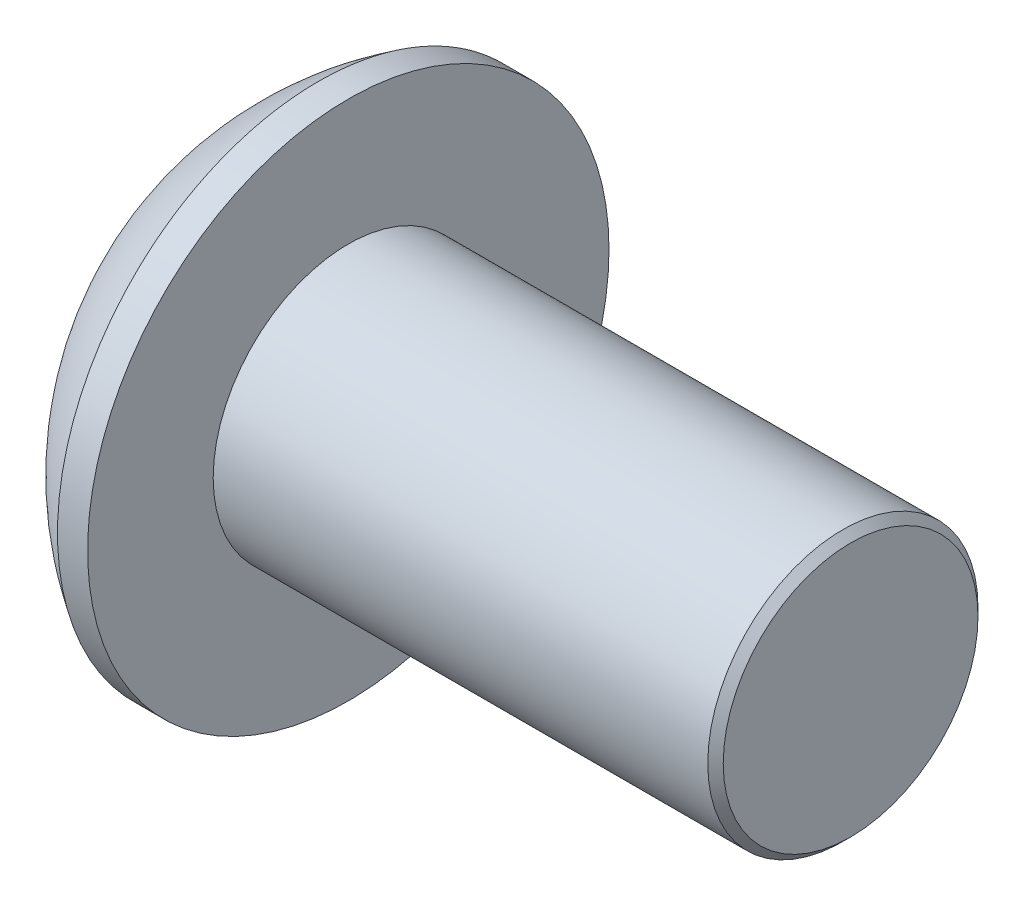
ISO-10303-21;
HEADER;
FILE_DESCRIPTION(('STEP AP214'),'2;1');
FILE_NAME('part.step','',(''),(''),'','','');
FILE_SCHEMA(('AUTOMOTIVE_DESIGN { 1 0 10303 214 1 1 1 1 }'));
ENDSEC;
DATA;
#1=APPLICATION_CONTEXT('core data for automotive mechanical design processes');
#2=APPLICATION_PROTOCOL_DEFINITION('international standard','automotive_design',2000,#1);
#3=PRODUCT_CONTEXT('',#1,'mechanical');
#4=PRODUCT('Part','Part','',(#3));
#5=PRODUCT_RELATED_PRODUCT_CATEGORY('part','',(#4));
#6=PRODUCT_DEFINITION_FORMATION('','',#4);
#7=PRODUCT_DEFINITION_CONTEXT('part definition',#1,'design');
#8=PRODUCT_DEFINITION('design','',#6,#7);
#9=PRODUCT_DEFINITION_SHAPE('','',#8);
#10=(LENGTH_UNIT() NAMED_UNIT(*) SI_UNIT(.MILLI.,.METRE.));
#11=(NAMED_UNIT(*) PLANE_ANGLE_UNIT() SI_UNIT($,.RADIAN.));
#12=(NAMED_UNIT(*) SI_UNIT($,.STERADIAN.) SOLID_ANGLE_UNIT());
#13=UNCERTAINTY_MEASURE_WITH_UNIT(LENGTH_MEASURE(1.E-05),#10,'distance_accuracy_value','');
#14=(GEOMETRIC_REPRESENTATION_CONTEXT(3) GLOBAL_UNCERTAINTY_ASSIGNED_CONTEXT((#13)) GLOBAL_UNIT_ASSIGNED_CONTEXT((#10,
#11,#12)) REPRESENTATION_CONTEXT('',''));
#15=CARTESIAN_POINT('',(0.,0.,0.));
#16=DIRECTION('',(0.,0.,1.));
#17=DIRECTION('',(1.,0.,0.));
#18=AXIS2_PLACEMENT_3D('',#15,#16,#17);
#19=CARTESIAN_POINT('',(1.32080000000034,0.,0.));
#20=DIRECTION('',(-1.,0.,0.));
#21=DIRECTION('',(0.,0.,-1.));
#22=AXIS2_PLACEMENT_3D('',#19,#20,#21);
#23=CONICAL_SURFACE('',#22,1.1937999999998,1.04719755119608);
#24=CARTESIAN_POINT('',(2.01004075135902,0.,-4.44089209850063E-13));
#25=VERTEX_POINT('',#24);
#26=VERTEX_LOOP('',#25);
#27=FACE_BOUND('',#26,.T.);
#28=CARTESIAN_POINT('',(1.32080000000009,0.,0.));
#29=DIRECTION('',(1.,0.,0.));
#30=DIRECTION('',(0.,0.,-1.));
#31=AXIS2_PLACEMENT_3D('',#28,#29,#30);
#32=CIRCLE('',#31,1.19380000000024);
#33=CARTESIAN_POINT('',(1.32080000000004,-1.03386112703797,-0.59690000000006));
#34=VERTEX_POINT('',#33);
#35=CARTESIAN_POINT('',(1.32080000000004,0.,-1.19380000000012));
#36=VERTEX_POINT('',#35);
#37=EDGE_CURVE('E37',#34,#36,#32,.T.);
#38=ORIENTED_EDGE('',*,*,#37,.F.);
#39=CARTESIAN_POINT('',(1.32080000000009,0.,0.));
#40=DIRECTION('',(1.,0.,0.));
#41=DIRECTION('',(0.,0.,-1.));
#42=AXIS2_PLACEMENT_3D('',#39,#40,#41);
#43=CIRCLE('',#42,1.19380000000024);
#44=CARTESIAN_POINT('',(1.32080000000004,-1.03386112703797,0.59690000000006));
#45=VERTEX_POINT('',#44);
#46=EDGE_CURVE('E127',#45,#34,#43,.T.);
#47=ORIENTED_EDGE('',*,*,#46,.F.);
#48=CARTESIAN_POINT('',(1.32080000000009,0.,0.));
#49=DIRECTION('',(1.,0.,0.));
#50=DIRECTION('',(0.,0.,-1.));
#51=AXIS2_PLACEMENT_3D('',#48,#49,#50);
#52=CIRCLE('',#51,1.19380000000024);
#53=CARTESIAN_POINT('',(1.32080000000004,1.49457637585666E-12,1.19380000000012));
#54=VERTEX_POINT('',#53);
#55=EDGE_CURVE('E133',#54,#45,#52,.T.);
#56=ORIENTED_EDGE('',*,*,#55,.F.);
#57=CARTESIAN_POINT('',(1.32080000000009,0.,0.));
#58=DIRECTION('',(1.,0.,0.));
#59=DIRECTION('',(0.,0.,-1.));
#60=AXIS2_PLACEMENT_3D('',#57,#58,#59);
#61=CIRCLE('',#60,1.19380000000024);
#62=CARTESIAN_POINT('',(1.32080000000004,1.03386112703797,0.596900000000061));
#63=VERTEX_POINT('',#62);
#64=EDGE_CURVE('E147',#63,#54,#61,.T.);
#65=ORIENTED_EDGE('',*,*,#64,.F.);
#66=CARTESIAN_POINT('',(1.32080000000009,0.,0.));
#67=DIRECTION('',(1.,0.,0.));
#68=DIRECTION('',(0.,0.,-1.));
#69=AXIS2_PLACEMENT_3D('',#66,#67,#68);
#70=CIRCLE('',#69,1.19380000000024);
#71=CARTESIAN_POINT('',(1.32080000000004,1.03386112703797,-0.596900000000061));
#72=VERTEX_POINT('',#71);
#73=EDGE_CURVE('E140',#72,#63,#70,.T.);
#74=ORIENTED_EDGE('',*,*,#73,.F.);
#75=CARTESIAN_POINT('',(1.32080000000009,0.,0.));
#76=DIRECTION('',(1.,0.,0.));
#77=DIRECTION('',(0.,0.,-1.));
#78=AXIS2_PLACEMENT_3D('',#75,#76,#77);
#79=CIRCLE('',#78,1.19380000000024);
#80=EDGE_CURVE('E137',#36,#72,#79,.T.);
#81=ORIENTED_EDGE('',*,*,#80,.F.);
#82=EDGE_LOOP('',(#38,#47,#56,#65,#74,#81));
#83=FACE_BOUND('',#82,.T.);
#84=ADVANCED_FACE('F34',(#27,#83),#23,.F.);
#85=CARTESIAN_POINT('',(1.3208,-2.06772225407572,1.1938));
#86=DIRECTION('',(1.,0.,0.));
#87=DIRECTION('',(0.,0.,1.));
#88=AXIS2_PLACEMENT_3D('',#85,#86,#87);
#89=PLANE('',#88);
#90=DIRECTION('',(0.,0.5,-0.866025403784439));
#91=VECTOR('',#90,1.);
#92=CARTESIAN_POINT('',(1.3208,-1.37848150271715,0.));
#93=LINE('',#92,#91);
#94=CARTESIAN_POINT('',(1.3208,-0.689240751358574,-1.1938));
#95=VERTEX_POINT('',#94);
#96=EDGE_CURVE('E109',#95,#34,#93,.F.);
#97=ORIENTED_EDGE('',*,*,#96,.T.);
#98=ORIENTED_EDGE('',*,*,#37,.T.);
#99=DIRECTION('',(0.,1.,0.));
#100=VECTOR('',#99,1.);
#101=CARTESIAN_POINT('',(1.3208,-0.689240751358574,-1.1938));
#102=LINE('',#101,#100);
#103=EDGE_CURVE('E124',#36,#95,#102,.F.);
#104=ORIENTED_EDGE('',*,*,#103,.T.);
#105=EDGE_LOOP('',(#97,#98,#104));
#106=FACE_BOUND('',#105,.T.);
#107=ADVANCED_FACE('F121',(#106),#89,.F.);
#108=CARTESIAN_POINT('',(1.3208,-2.06772225407572,1.1938));
#109=DIRECTION('',(1.,0.,0.));
#110=DIRECTION('',(0.,0.,1.));
#111=AXIS2_PLACEMENT_3D('',#108,#109,#110);
#112=PLANE('',#111);
#113=DIRECTION('',(0.,-0.5,-0.866025403784439));
#114=VECTOR('',#113,1.);
#115=CARTESIAN_POINT('',(1.3208,-0.689240751358574,1.1938));
#116=LINE('',#115,#114);
#117=CARTESIAN_POINT('',(1.3208,-1.37848150271715,0.));
#118=VERTEX_POINT('',#117);
#119=EDGE_CURVE('E129',#118,#45,#116,.F.);
#120=ORIENTED_EDGE('',*,*,#119,.T.);
#121=ORIENTED_EDGE('',*,*,#46,.T.);
#122=DIRECTION('',(0.,0.5,-0.866025403784439));
#123=VECTOR('',#122,1.);
#124=CARTESIAN_POINT('',(1.3208,-1.37848150271715,0.));
#125=LINE('',#124,#123);
#126=EDGE_CURVE('E104',#34,#118,#125,.F.);
#127=ORIENTED_EDGE('',*,*,#126,.T.);
#128=EDGE_LOOP('',(#120,#121,#127));
#129=FACE_BOUND('',#128,.T.);
#130=ADVANCED_FACE('F128',(#129),#112,.F.);
#131=CARTESIAN_POINT('',(1.3208,-2.06772225407572,1.1938));
#132=DIRECTION('',(1.,0.,0.));
#133=DIRECTION('',(0.,0.,1.));
#134=AXIS2_PLACEMENT_3D('',#131,#132,#133);
#135=PLANE('',#134);
#136=DIRECTION('',(0.,1.,0.));
#137=VECTOR('',#136,1.);
#138=CARTESIAN_POINT('',(1.3208,0.689240751358577,1.1938));
#139=LINE('',#138,#137);
#140=CARTESIAN_POINT('',(1.3208,-0.689240751358574,1.1938));
#141=VERTEX_POINT('',#140);
#142=EDGE_CURVE('E166',#141,#54,#139,.T.);
#143=ORIENTED_EDGE('',*,*,#142,.T.);
#144=ORIENTED_EDGE('',*,*,#55,.T.);
#145=DIRECTION('',(0.,-0.5,-0.866025403784439));
#146=VECTOR('',#145,1.);
#147=CARTESIAN_POINT('',(1.3208,-0.689240751358574,1.1938));
#148=LINE('',#147,#146);
#149=EDGE_CURVE('E164',#45,#141,#148,.F.);
#150=ORIENTED_EDGE('',*,*,#149,.T.);
#151=EDGE_LOOP('',(#143,#144,#150));
#152=FACE_BOUND('',#151,.T.);
#153=ADVANCED_FACE('F163',(#152),#135,.F.);
#154=CARTESIAN_POINT('',(1.3208,-2.06772225407572,1.1938));
#155=DIRECTION('',(1.,0.,0.));
#156=DIRECTION('',(0.,0.,1.));
#157=AXIS2_PLACEMENT_3D('',#154,#155,#156);
#158=PLANE('',#157);
#159=DIRECTION('',(0.,-0.5,0.866025403784439));
#160=VECTOR('',#159,1.);
#161=CARTESIAN_POINT('',(1.3208,1.37848150271715,0.));
#162=LINE('',#161,#160);
#163=CARTESIAN_POINT('',(1.3208,0.689240751358577,1.1938));
#164=VERTEX_POINT('',#163);
#165=EDGE_CURVE('E173',#164,#63,#162,.F.);
#166=ORIENTED_EDGE('',*,*,#165,.T.);
#167=ORIENTED_EDGE('',*,*,#64,.T.);
#168=DIRECTION('',(0.,1.,0.));
#169=VECTOR('',#168,1.);
#170=CARTESIAN_POINT('',(1.3208,0.689240751358577,1.1938));
#171=LINE('',#170,#169);
#172=EDGE_CURVE('E171',#54,#164,#171,.T.);
#173=ORIENTED_EDGE('',*,*,#172,.T.);
#174=EDGE_LOOP('',(#166,#167,#173));
#175=FACE_BOUND('',#174,.T.);
#176=ADVANCED_FACE('F170',(#175),#158,.F.);
#177=CARTESIAN_POINT('',(1.3208,-2.06772225407572,1.1938));
#178=DIRECTION('',(1.,0.,0.));
#179=DIRECTION('',(0.,0.,1.));
#180=AXIS2_PLACEMENT_3D('',#177,#178,#179);
#181=PLANE('',#180);
#182=DIRECTION('',(0.,0.5,0.866025403784439));
#183=VECTOR('',#182,1.);
#184=CARTESIAN_POINT('',(1.3208,0.689240751358576,-1.1938));
#185=LINE('',#184,#183);
#186=CARTESIAN_POINT('',(1.3208,1.37848150271715,0.));
#187=VERTEX_POINT('',#186);
#188=EDGE_CURVE('E184',#187,#72,#185,.F.);
#189=ORIENTED_EDGE('',*,*,#188,.T.);
#190=ORIENTED_EDGE('',*,*,#73,.T.);
#191=DIRECTION('',(0.,-0.5,0.866025403784439));
#192=VECTOR('',#191,1.);
#193=CARTESIAN_POINT('',(1.3208,1.37848150271715,0.));
#194=LINE('',#193,#192);
#195=EDGE_CURVE('E176',#63,#187,#194,.F.);
#196=ORIENTED_EDGE('',*,*,#195,.T.);
#197=EDGE_LOOP('',(#189,#190,#196));
#198=FACE_BOUND('',#197,.T.);
#199=ADVANCED_FACE('F182',(#198),#181,.F.);
#200=CARTESIAN_POINT('',(1.3208,-2.06772225407572,1.1938));
#201=DIRECTION('',(1.,0.,0.));
#202=DIRECTION('',(0.,0.,1.));
#203=AXIS2_PLACEMENT_3D('',#200,#201,#202);
#204=PLANE('',#203);
#205=DIRECTION('',(0.,1.,0.));
#206=VECTOR('',#205,1.);
#207=CARTESIAN_POINT('',(1.3208,-0.689240751358574,-1.1938));
#208=LINE('',#207,#206);
#209=CARTESIAN_POINT('',(1.3208,0.689240751358576,-1.1938));
#210=VERTEX_POINT('',#209);
#211=EDGE_CURVE('E144',#210,#36,#208,.F.);
#212=ORIENTED_EDGE('',*,*,#211,.T.);
#213=ORIENTED_EDGE('',*,*,#80,.T.);
#214=DIRECTION('',(0.,0.5,0.866025403784439));
#215=VECTOR('',#214,1.);
#216=CARTESIAN_POINT('',(1.3208,0.689240751358576,-1.1938));
#217=LINE('',#216,#215);
#218=EDGE_CURVE('E186',#72,#210,#217,.F.);
#219=ORIENTED_EDGE('',*,*,#218,.T.);
#220=EDGE_LOOP('',(#212,#213,#219));
#221=FACE_BOUND('',#220,.T.);
#222=ADVANCED_FACE('F307',(#221),#204,.F.);
#223=CARTESIAN_POINT('',(1.3208,-0.689240751358574,-1.1938));
#224=DIRECTION('',(0.,0.,1.));
#225=DIRECTION('',(0.,1.,0.));
#226=AXIS2_PLACEMENT_3D('',#223,#224,#225);
#227=PLANE('',#226);
#228=DIRECTION('',(0.,1.,0.));
#229=VECTOR('',#228,1.);
#230=CARTESIAN_POINT('',(0.,0.,-1.1938));
#231=LINE('',#230,#229);
#232=CARTESIAN_POINT('',(0.,0.689240751358577,-1.1938));
#233=VERTEX_POINT('',#232);
#234=CARTESIAN_POINT('',(0.,-0.689240751358574,-1.1938));
#235=VERTEX_POINT('',#234);
#236=EDGE_CURVE('E194',#233,#235,#231,.F.);
#237=ORIENTED_EDGE('',*,*,#236,.T.);
#238=DIRECTION('',(1.,0.,0.));
#239=VECTOR('',#238,1.);
#240=CARTESIAN_POINT('',(1.3208,-0.689240751358574,-1.1938));
#241=LINE('',#240,#239);
#242=EDGE_CURVE('E116',#235,#95,#241,.T.);
#243=ORIENTED_EDGE('',*,*,#242,.T.);
#244=ORIENTED_EDGE('',*,*,#103,.F.);
#245=ORIENTED_EDGE('',*,*,#211,.F.);
#246=DIRECTION('',(1.,0.,0.));
#247=VECTOR('',#246,1.);
#248=CARTESIAN_POINT('',(1.3208,0.689240751358576,-1.1938));
#249=LINE('',#248,#247);
#250=EDGE_CURVE('E189',#210,#233,#249,.F.);
#251=ORIENTED_EDGE('',*,*,#250,.T.);
#252=EDGE_LOOP('',(#237,#243,#244,#245,#251));
#253=FACE_BOUND('',#252,.T.);
#254=ADVANCED_FACE('F273',(#253),#227,.T.);
#255=CARTESIAN_POINT('',(1.3208,-1.37848150271715,0.));
#256=DIRECTION('',(0.,0.866025403784439,0.5));
#257=DIRECTION('',(0.,0.5,-0.866025403784439));
#258=AXIS2_PLACEMENT_3D('',#255,#256,#257);
#259=PLANE('',#258);
#260=DIRECTION('',(0.,-0.5,0.866025403784439));
#261=VECTOR('',#260,1.);
#262=CARTESIAN_POINT('',(0.,-0.689240751358574,-1.1938));
#263=LINE('',#262,#261);
#264=CARTESIAN_POINT('',(0.,-1.37848150271715,0.));
#265=VERTEX_POINT('',#264);
#266=EDGE_CURVE('E270',#235,#265,#263,.T.);
#267=ORIENTED_EDGE('',*,*,#266,.T.);
#268=DIRECTION('',(1.,0.,0.));
#269=VECTOR('',#268,1.);
#270=CARTESIAN_POINT('',(1.3208,-1.37848150271715,0.));
#271=LINE('',#270,#269);
#272=EDGE_CURVE('E111',#265,#118,#271,.T.);
#273=ORIENTED_EDGE('',*,*,#272,.T.);
#274=ORIENTED_EDGE('',*,*,#126,.F.);
#275=ORIENTED_EDGE('',*,*,#96,.F.);
#276=ORIENTED_EDGE('',*,*,#242,.F.);
#277=EDGE_LOOP('',(#267,#273,#274,#275,#276));
#278=FACE_BOUND('',#277,.T.);
#279=ADVANCED_FACE('F107',(#278),#259,.T.);
#280=CARTESIAN_POINT('',(1.3208,-0.689240751358574,1.1938));
#281=DIRECTION('',(0.,0.866025403784439,-0.5));
#282=DIRECTION('',(0.,-0.5,-0.866025403784439));
#283=AXIS2_PLACEMENT_3D('',#280,#281,#282);
#284=PLANE('',#283);
#285=DIRECTION('',(0.,0.5,0.866025403784439));
#286=VECTOR('',#285,1.);
#287=CARTESIAN_POINT('',(0.,-1.37848150271715,0.));
#288=LINE('',#287,#286);
#289=CARTESIAN_POINT('',(0.,-0.689240751358574,1.1938));
#290=VERTEX_POINT('',#289);
#291=EDGE_CURVE('E268',#265,#290,#288,.T.);
#292=ORIENTED_EDGE('',*,*,#291,.T.);
#293=DIRECTION('',(1.,0.,0.));
#294=VECTOR('',#293,1.);
#295=CARTESIAN_POINT('',(1.3208,-0.689240751358574,1.1938));
#296=LINE('',#295,#294);
#297=EDGE_CURVE('E177',#290,#141,#296,.T.);
#298=ORIENTED_EDGE('',*,*,#297,.T.);
#299=ORIENTED_EDGE('',*,*,#149,.F.);
#300=ORIENTED_EDGE('',*,*,#119,.F.);
#301=ORIENTED_EDGE('',*,*,#272,.F.);
#302=EDGE_LOOP('',(#292,#298,#299,#300,#301));
#303=FACE_BOUND('',#302,.T.);
#304=ADVANCED_FACE('F278',(#303),#284,.T.);
#305=CARTESIAN_POINT('',(1.3208,0.689240751358577,1.1938));
#306=DIRECTION('',(0.,0.,-1.));
#307=DIRECTION('',(1.,0.,0.));
#308=AXIS2_PLACEMENT_3D('',#305,#306,#307);
#309=PLANE('',#308);
#310=DIRECTION('',(0.,1.,0.));
#311=VECTOR('',#310,1.);
#312=CARTESIAN_POINT('',(0.,0.,1.1938));
#313=LINE('',#312,#311);
#314=CARTESIAN_POINT('',(0.,0.689240751358577,1.1938));
#315=VERTEX_POINT('',#314);
#316=EDGE_CURVE('E260',#290,#315,#313,.T.);
#317=ORIENTED_EDGE('',*,*,#316,.T.);
#318=DIRECTION('',(1.,0.,0.));
#319=VECTOR('',#318,1.);
#320=CARTESIAN_POINT('',(1.3208,0.689240751358577,1.1938));
#321=LINE('',#320,#319);
#322=EDGE_CURVE('E187',#315,#164,#321,.T.);
#323=ORIENTED_EDGE('',*,*,#322,.T.);
#324=ORIENTED_EDGE('',*,*,#172,.F.);
#325=ORIENTED_EDGE('',*,*,#142,.F.);
#326=ORIENTED_EDGE('',*,*,#297,.F.);
#327=EDGE_LOOP('',(#317,#323,#324,#325,#326));
#328=FACE_BOUND('',#327,.T.);
#329=ADVANCED_FACE('F280',(#328),#309,.T.);
#330=CARTESIAN_POINT('',(1.3208,1.37848150271715,0.));
#331=DIRECTION('',(0.,-0.866025403784439,-0.5));
#332=DIRECTION('',(0.,-0.5,0.866025403784439));
#333=AXIS2_PLACEMENT_3D('',#330,#331,#332);
#334=PLANE('',#333);
#335=DIRECTION('',(0.,0.5,-0.866025403784439));
#336=VECTOR('',#335,1.);
#337=CARTESIAN_POINT('',(0.,0.689240751358577,1.1938));
#338=LINE('',#337,#336);
#339=CARTESIAN_POINT('',(0.,1.37848150271715,0.));
#340=VERTEX_POINT('',#339);
#341=EDGE_CURVE('E257',#315,#340,#338,.T.);
#342=ORIENTED_EDGE('',*,*,#341,.T.);
#343=DIRECTION('',(1.,0.,0.));
#344=VECTOR('',#343,1.);
#345=CARTESIAN_POINT('',(1.3208,1.37848150271715,0.));
#346=LINE('',#345,#344);
#347=EDGE_CURVE('E202',#340,#187,#346,.T.);
#348=ORIENTED_EDGE('',*,*,#347,.T.);
#349=ORIENTED_EDGE('',*,*,#195,.F.);
#350=ORIENTED_EDGE('',*,*,#165,.F.);
#351=ORIENTED_EDGE('',*,*,#322,.F.);
#352=EDGE_LOOP('',(#342,#348,#349,#350,#351));
#353=FACE_BOUND('',#352,.T.);
#354=ADVANCED_FACE('F281',(#353),#334,.T.);
#355=CARTESIAN_POINT('',(1.3208,0.689240751358576,-1.1938));
#356=DIRECTION('',(0.,-0.866025403784439,0.5));
#357=DIRECTION('',(0.,0.5,0.866025403784439));
#358=AXIS2_PLACEMENT_3D('',#355,#356,#357);
#359=PLANE('',#358);
#360=DIRECTION('',(0.,-0.5,-0.866025403784439));
#361=VECTOR('',#360,1.);
#362=CARTESIAN_POINT('',(0.,1.37848150271715,0.));
#363=LINE('',#362,#361);
#364=EDGE_CURVE('E52',#340,#233,#363,.T.);
#365=ORIENTED_EDGE('',*,*,#364,.T.);
#366=ORIENTED_EDGE('',*,*,#250,.F.);
#367=ORIENTED_EDGE('',*,*,#218,.F.);
#368=ORIENTED_EDGE('',*,*,#188,.F.);
#369=ORIENTED_EDGE('',*,*,#347,.F.);
#370=EDGE_LOOP('',(#365,#366,#367,#368,#369));
#371=FACE_BOUND('',#370,.T.);
#372=ADVANCED_FACE('F282',(#371),#359,.T.);
#373=CARTESIAN_POINT('',(0.,0.,0.));
#374=DIRECTION('',(-1.,0.,0.));
#375=DIRECTION('',(0.,0.,-1.));
#376=AXIS2_PLACEMENT_3D('',#373,#374,#375);
#377=PLANE('',#376);
#378=ORIENTED_EDGE('',*,*,#341,.F.);
#379=ORIENTED_EDGE('',*,*,#316,.F.);
#380=ORIENTED_EDGE('',*,*,#291,.F.);
#381=ORIENTED_EDGE('',*,*,#266,.F.);
#382=ORIENTED_EDGE('',*,*,#236,.F.);
#383=ORIENTED_EDGE('',*,*,#364,.F.);
#384=EDGE_LOOP('',(#378,#379,#380,#381,#382,#383));
#385=FACE_BOUND('',#384,.T.);
#386=CARTESIAN_POINT('',(0.,1.647825,0.));
#387=CARTESIAN_POINT('',(1.63319194702151E-13,1.64781976319874,-0.092490203977753));
#388=CARTESIAN_POINT('',(1.32890083579297E-13,1.63999511633709,-0.18514501432637));
#389=CARTESIAN_POINT('',(0.,1.6167119250047,-0.322075808080013));
#390=CARTESIAN_POINT('',(-1.58500729597374E-13,1.60700618770234,-0.36743553339636));
#391=CARTESIAN_POINT('',(1.59063479291743E-13,1.58380101865853,-0.45722093569514));
#392=CARTESIAN_POINT('',(5.6924253476393E-13,1.5702985083103,-0.501645823115263));
#393=CARTESIAN_POINT('',(9.37393023603841E-13,1.52428156574313,-0.632817459278967));
#394=CARTESIAN_POINT('',(0.,1.48621992666366,-0.717681965518643));
#395=CARTESIAN_POINT('',(0.,1.39637079695658,-0.879809706624016));
#396=CARTESIAN_POINT('',(7.82184274151218E-13,1.34458278455109,-0.957072652379994));
#397=CARTESIAN_POINT('',(4.86982737501784E-13,1.25777784714521,-1.06558770210237));
#398=CARTESIAN_POINT('',(1.33453761487452E-13,1.22729946114794,-1.10054993332365));
#399=CARTESIAN_POINT('',(-1.3289162015903E-13,1.16354004969107,-1.16775237388221));
#400=CARTESIAN_POINT('',(0.,1.13026175473033,-1.19999517515816));
#401=CARTESIAN_POINT('',(0.,1.02649304340867,-1.29236218866442));
#402=CARTESIAN_POINT('',(0.,0.952049986714076,-1.34814848277712));
#403=CARTESIAN_POINT('',(0.,0.794895196754067,-1.44639825105765));
#404=CARTESIAN_POINT('',(0.,0.712183775431296,-1.48886222758992));
#405=CARTESIAN_POINT('',(0.,0.540796624265731,-1.55930919813143));
#406=CARTESIAN_POINT('',(0.,0.452120958135287,-1.58729234680268));
#407=CARTESIAN_POINT('',(0.,0.271332331080319,-1.62797191307413));
#408=CARTESIAN_POINT('',(0.,0.179219351801791,-1.64066824903626));
#409=CARTESIAN_POINT('',(0.,-0.00583077027840617,-1.65041748705408));
#410=CARTESIAN_POINT('',(0.,-0.0987679130800753,-1.64747038910978));
#411=CARTESIAN_POINT('',(0.,-0.282830196388822,-1.62601274134435));
#412=CARTESIAN_POINT('',(0.,-0.373955346570016,-1.60750227463794));
#413=CARTESIAN_POINT('',(0.,-0.551796068178801,-1.55545413364523));
#414=CARTESIAN_POINT('',(0.,-0.638511592498163,-1.52191629885843));
#415=CARTESIAN_POINT('',(0.,-0.805120175533149,-1.44072378052346));
#416=CARTESIAN_POINT('',(0.,-0.885012976819951,-1.39306856461393));
#417=CARTESIAN_POINT('',(0.,-0.997912879588355,-1.31211658756413));
#418=CARTESIAN_POINT('',(0.,-1.0343949246834,-1.28354906167734));
#419=CARTESIAN_POINT('',(0.,-1.10486279842068,-1.22341829303709));
#420=CARTESIAN_POINT('',(0.,-1.13884618403291,-1.19185218578117));
#421=CARTESIAN_POINT('',(0.,-1.23657300939908,-1.09305906467359));
#422=CARTESIAN_POINT('',(0.,-1.29619288399356,-1.02166556658612));
#423=CARTESIAN_POINT('',(0.,-1.40258050817755,-0.869876423478031));
#424=CARTESIAN_POINT('',(0.,-1.44934874627766,-0.789481120793477));
#425=CARTESIAN_POINT('',(0.,-1.50889406070375,-0.66387095931334));
#426=CARTESIAN_POINT('',(0.,-1.52698985473586,-0.621110806760426));
#427=CARTESIAN_POINT('',(0.,-1.55950093966664,-0.53426077686433));
#428=CARTESIAN_POINT('',(-1.05235362596779E-13,-1.57391920916438,-0.490172008203167));
#429=CARTESIAN_POINT('',(2.10568324685354E-13,-1.61146177909579,-0.356445777718595));
#430=CARTESIAN_POINT('',(1.14396658334039E-12,-1.62897899568074,-0.265126085962904));
#431=CARTESIAN_POINT('',(4.347347107204E-13,-1.64174347214908,-0.144386595969386));
#432=CARTESIAN_POINT('',(1.21682740895759E-13,-1.64402207668915,-0.115560405797873));
#433=CARTESIAN_POINT('',(-1.21249060026839E-13,-1.6470636594012,-0.0578281757252688));
#434=CARTESIAN_POINT('',(0.,-1.64782663757318,-0.0289221358241775));
#435=CARTESIAN_POINT('',(1.63505268006993E-13,-1.64781976319874,0.0924902039777536));
#436=CARTESIAN_POINT('',(1.32794566155401E-13,-1.63999511633709,0.18514501432637));
#437=CARTESIAN_POINT('',(0.,-1.6167119250047,0.322075808080014));
#438=CARTESIAN_POINT('',(-1.58310187784522E-13,-1.60700618770234,0.367435533396361));
#439=CARTESIAN_POINT('',(1.58872782530651E-13,-1.58380101865853,0.45722093569514));
#440=CARTESIAN_POINT('',(5.68527399730162E-13,-1.5702985083103,0.501645823115263));
#441=CARTESIAN_POINT('',(9.36221934104128E-13,-1.52428156574313,0.632817459278966));
#442=CARTESIAN_POINT('',(0.,-1.48621992666366,0.717681965518643));
#443=CARTESIAN_POINT('',(0.,-1.39637079695658,0.879809706624015));
#444=CARTESIAN_POINT('',(7.80985332757399E-13,-1.34458278455109,0.957072652379992));
#445=CARTESIAN_POINT('',(4.86281382838322E-13,-1.25777784714521,1.06558770210237));
#446=CARTESIAN_POINT('',(1.33300307899813E-13,-1.22729946114794,1.10054993332365));
#447=CARTESIAN_POINT('',(-1.32738314523762E-13,-1.16354004969107,1.16775237388221));
#448=CARTESIAN_POINT('',(0.,-1.13026175473033,1.19999517515816));
#449=CARTESIAN_POINT('',(0.,-1.02649304340867,1.29236218866442));
#450=CARTESIAN_POINT('',(0.,-0.952049986714081,1.34814848277713));
#451=CARTESIAN_POINT('',(0.,-0.794895196754072,1.44639825105765));
#452=CARTESIAN_POINT('',(0.,-0.7121837754313,1.48886222758992));
#453=CARTESIAN_POINT('',(0.,-0.540796624265734,1.55930919813143));
#454=CARTESIAN_POINT('',(0.,-0.452120958135291,1.58729234680268));
#455=CARTESIAN_POINT('',(0.,-0.271332331080322,1.62797191307413));
#456=CARTESIAN_POINT('',(0.,-0.179219351801793,1.64066824903626));
#457=CARTESIAN_POINT('',(0.,0.0058307702784039,1.65041748705408));
#458=CARTESIAN_POINT('',(0.,0.0987679130800731,1.64747038910978));
#459=CARTESIAN_POINT('',(0.,0.28283019638882,1.62601274134436));
#460=CARTESIAN_POINT('',(0.,0.373955346570014,1.60750227463794));
#461=CARTESIAN_POINT('',(0.,0.551796068178799,1.55545413364523));
#462=CARTESIAN_POINT('',(0.,0.63851159249816,1.52191629885844));
#463=CARTESIAN_POINT('',(0.,0.805120175533147,1.44072378052347));
#464=CARTESIAN_POINT('',(0.,0.88501297681995,1.39306856461393));
#465=CARTESIAN_POINT('',(0.,0.997912879588353,1.31211658756413));
#466=CARTESIAN_POINT('',(0.,1.03439492468339,1.28354906167734));
#467=CARTESIAN_POINT('',(0.,1.10486279842068,1.22341829303709));
#468=CARTESIAN_POINT('',(0.,1.1388461840329,1.19185218578117));
#469=CARTESIAN_POINT('',(0.,1.23657300939908,1.09305906467358));
#470=CARTESIAN_POINT('',(0.,1.29619288399356,1.02166556658612));
#471=CARTESIAN_POINT('',(0.,1.40258050817755,0.869876423478031));
#472=CARTESIAN_POINT('',(0.,1.44934874627765,0.789481120793475));
#473=CARTESIAN_POINT('',(0.,1.50889406070375,0.66387095931334));
#474=CARTESIAN_POINT('',(0.,1.52698985473586,0.621110806760427));
#475=CARTESIAN_POINT('',(0.,1.55950093966664,0.534260776864331));
#476=CARTESIAN_POINT('',(-1.05163336027755E-13,1.57391920916438,0.490172008203168));
#477=CARTESIAN_POINT('',(2.10424649207135E-13,1.61146177909579,0.356445777718595));
#478=CARTESIAN_POINT('',(1.1439193518672E-12,1.62897899568074,0.265126085962905));
#479=CARTESIAN_POINT('',(4.34749480231378E-13,1.64174347214908,0.144386595969387));
#480=CARTESIAN_POINT('',(1.21707467703441E-13,1.64402207668915,0.115560405797874));
#481=CARTESIAN_POINT('',(-1.21273786834522E-13,1.6470636594012,0.0578281757252697));
#482=CARTESIAN_POINT('',(0.,1.64782663757318,0.0289221358241784));
#483=CARTESIAN_POINT('',(0.,1.647825,0.));
#484=B_SPLINE_CURVE_WITH_KNOTS('',3,(#386,#387,#388,#389,#390,#391,#392,#393,#394,#395,#396,
#397,#398,#399,#400,#401,#402,#403,#404,#405,#406,#407,#408,#409,#410,#411,#412,#413,#414,#415,
#416,#417,#418,#419,#420,#421,#422,#423,#424,#425,#426,#427,#428,#429,#430,#431,#432,#433,#434,
#435,#436,#437,#438,#439,#440,#441,#442,#443,#444,#445,#446,#447,#448,#449,#450,#451,#452,#453,
#454,#455,#456,#457,#458,#459,#460,#461,#462,#463,#464,#465,#466,#467,#468,#469,#470,#471,#472,
#473,#474,#475,#476,#477,#478,#479,#480,#481,#482,#483),.UNSPECIFIED.,.T.,.F.,(4,2,2,2,2,2,2,2,
2,2,2,2,2,2,2,2,2,2,2,2,2,2,2,2,2,2,2,2,2,2,2,2,2,2,2,2,2,2,2,2,2,2,2,2,2,2,2,2,4),(0.,
0.277336029422426,0.416368541537111,0.5555141146256,0.833141970294987,1.11078038089036,
1.24978149120748,1.38864858351854,1.66629367015056,1.94392828594775,2.22155993641642,
2.49919306954937,2.77682620268234,3.05445785315101,3.3320924689482,3.6097375555799,
3.74860464789074,3.88760575820767,4.16524416880332,4.44287202447287,4.5820175975616,
4.72105010967662,4.99838613909882,5.08511046196677,5.17183478483476,5.44917081425719,
5.58820332637187,5.72734889946036,6.00497675512975,6.28261516572512,6.42161627604224,
6.5604833683533,6.83812845498532,7.11576307078251,7.39339472125118,7.67102785438413,
7.9486609875171,8.22629263798578,8.50392725378296,8.78157234041466,8.9204394327255,
9.05944054304243,9.33707895363808,9.61470680930764,9.75385238239637,9.89288489451138,
10.1702209239336,10.2569452468015,10.3436695696695),.UNSPECIFIED.);
#485=CARTESIAN_POINT('',(0.,1.647825,0.));
#486=VERTEX_POINT('',#485);
#487=EDGE_CURVE('E150',#486,#486,#484,.T.);
#488=ORIENTED_EDGE('',*,*,#487,.T.);
#489=EDGE_LOOP('',(#488));
#490=FACE_BOUND('',#489,.T.);
#491=ADVANCED_FACE('F275',(#385,#490),#377,.T.);
#492=CARTESIAN_POINT('',(3.50132362607759,0.,0.));
#493=DIRECTION('',(0.,1.,0.));
#494=DIRECTION('',(1.,0.,0.));
#495=AXIS2_PLACEMENT_3D('',#492,#493,#494);
#496=SPHERICAL_SURFACE('',#495,3.86970210289553);
#497=CARTESIAN_POINT('',(1.4732,0.,0.));
#498=DIRECTION('',(1.,0.,0.));
#499=DIRECTION('',(0.,0.,-1.));
#500=AXIS2_PLACEMENT_3D('',#497,#498,#499);
#501=CIRCLE('',#500,3.29565);
#502=CARTESIAN_POINT('',(1.4732,0.,-3.29565));
#503=VERTEX_POINT('',#502);
#504=EDGE_CURVE('E250',#503,#503,#501,.F.);
#505=ORIENTED_EDGE('',*,*,#504,.T.);
#506=EDGE_LOOP('',(#505));
#507=FACE_BOUND('',#506,.T.);
#508=ORIENTED_EDGE('',*,*,#487,.F.);
#509=EDGE_LOOP('',(#508));
#510=FACE_BOUND('',#509,.T.);
#511=ADVANCED_FACE('F289',(#507,#510),#496,.T.);
#512=CARTESIAN_POINT('',(8.2042,0.,0.));
#513=DIRECTION('',(-1.,0.,0.));
#514=DIRECTION('',(0.,0.,-1.));
#515=AXIS2_PLACEMENT_3D('',#512,#513,#514);
#516=PLANE('',#515);
#517=CARTESIAN_POINT('',(8.20419999996602,0.,0.));
#518=DIRECTION('',(1.,0.,0.));
#519=DIRECTION('',(0.,0.,-1.));
#520=AXIS2_PLACEMENT_3D('',#517,#518,#519);
#521=CIRCLE('',#520,1.61036000002923);
#522=CARTESIAN_POINT('',(8.20419999996602,0.,-1.61036000002923));
#523=VERTEX_POINT('',#522);
#524=EDGE_CURVE('E248',#523,#523,#521,.T.);
#525=ORIENTED_EDGE('',*,*,#524,.T.);
#526=EDGE_LOOP('',(#525));
#527=FACE_BOUND('',#526,.T.);
#528=ADVANCED_FACE('F346',(#527),#516,.F.);
#529=CARTESIAN_POINT('',(0.,0.,0.));
#530=DIRECTION('',(-1.,0.,0.));
#531=DIRECTION('',(0.,0.,-1.));
#532=AXIS2_PLACEMENT_3D('',#529,#530,#531);
#533=CYLINDRICAL_SURFACE('',#532,3.29565);
#534=ORIENTED_EDGE('',*,*,#504,.F.);
#535=EDGE_LOOP('',(#534));
#536=FACE_BOUND('',#535,.T.);
#537=CARTESIAN_POINT('',(1.8542,0.,0.));
#538=DIRECTION('',(1.,0.,0.));
#539=DIRECTION('',(0.,0.,-1.));
#540=AXIS2_PLACEMENT_3D('',#537,#538,#539);
#541=CIRCLE('',#540,3.29565);
#542=CARTESIAN_POINT('',(1.8542,0.,-3.29565));
#543=VERTEX_POINT('',#542);
#544=EDGE_CURVE('E245',#543,#543,#541,.T.);
#545=ORIENTED_EDGE('',*,*,#544,.F.);
#546=EDGE_LOOP('',(#545));
#547=FACE_BOUND('',#546,.T.);
#548=ADVANCED_FACE('F354',(#536,#547),#533,.T.);
#549=CARTESIAN_POINT('',(8.10640999998213,0.,0.));
#550=DIRECTION('',(-1.,0.,0.));
#551=DIRECTION('',(0.,0.,-1.));
#552=AXIS2_PLACEMENT_3D('',#549,#550,#551);
#553=CONICAL_SURFACE('',#552,1.70814999995628,0.785398163106808);
#554=CARTESIAN_POINT('',(8.10641,0.,0.));
#555=DIRECTION('',(1.,0.,0.));
#556=DIRECTION('',(0.,0.,-1.));
#557=AXIS2_PLACEMENT_3D('',#554,#555,#556);
#558=CIRCLE('',#557,1.70815);
#559=CARTESIAN_POINT('',(8.10641,0.,-1.70815));
#560=VERTEX_POINT('',#559);
#561=EDGE_CURVE('E43',#560,#560,#558,.T.);
#562=ORIENTED_EDGE('',*,*,#561,.T.);
#563=EDGE_LOOP('',(#562));
#564=FACE_BOUND('',#563,.T.);
#565=ORIENTED_EDGE('',*,*,#524,.F.);
#566=EDGE_LOOP('',(#565));
#567=FACE_BOUND('',#566,.T.);
#568=ADVANCED_FACE('F364',(#564,#567),#553,.T.);
#569=CARTESIAN_POINT('',(1.8542,1.70815,0.));
#570=DIRECTION('',(-1.,0.,0.));
#571=DIRECTION('',(0.,0.,-1.));
#572=AXIS2_PLACEMENT_3D('',#569,#570,#571);
#573=PLANE('',#572);
#574=CARTESIAN_POINT('',(1.8542,0.,0.));
#575=DIRECTION('',(1.,0.,0.));
#576=DIRECTION('',(0.,0.,-1.));
#577=AXIS2_PLACEMENT_3D('',#574,#575,#576);
#578=CIRCLE('',#577,1.70815);
#579=CARTESIAN_POINT('',(1.8542,0.,-1.70815));
#580=VERTEX_POINT('',#579);
#581=EDGE_CURVE('E11',#580,#580,#578,.F.);
#582=ORIENTED_EDGE('',*,*,#581,.T.);
#583=EDGE_LOOP('',(#582));
#584=FACE_BOUND('',#583,.T.);
#585=ORIENTED_EDGE('',*,*,#544,.T.);
#586=EDGE_LOOP('',(#585));
#587=FACE_BOUND('',#586,.T.);
#588=ADVANCED_FACE('F374',(#584,#587),#573,.F.);
#589=CARTESIAN_POINT('',(0.,0.,0.));
#590=DIRECTION('',(-1.,0.,0.));
#591=DIRECTION('',(0.,0.,-1.));
#592=AXIS2_PLACEMENT_3D('',#589,#590,#591);
#593=CYLINDRICAL_SURFACE('',#592,1.70815);
#594=ORIENTED_EDGE('',*,*,#581,.F.);
#595=EDGE_LOOP('',(#594));
#596=FACE_BOUND('',#595,.T.);
#597=ORIENTED_EDGE('',*,*,#561,.F.);
#598=EDGE_LOOP('',(#597));
#599=FACE_BOUND('',#598,.T.);
#600=ADVANCED_FACE('F384',(#596,#599),#593,.T.);
#601=CLOSED_SHELL('',(#84,#107,#130,#153,#176,#199,#222,#254,#279,#304,#329,#354,#372,#491,#511,
#528,#548,#568,#588,#600));
#602=MANIFOLD_SOLID_BREP('B2',#601);
#603=ADVANCED_BREP_SHAPE_REPRESENTATION('',(#18,#602),#14);
#604=SHAPE_DEFINITION_REPRESENTATION(#9,#603);
ENDSEC;
END-ISO-10303-21;
